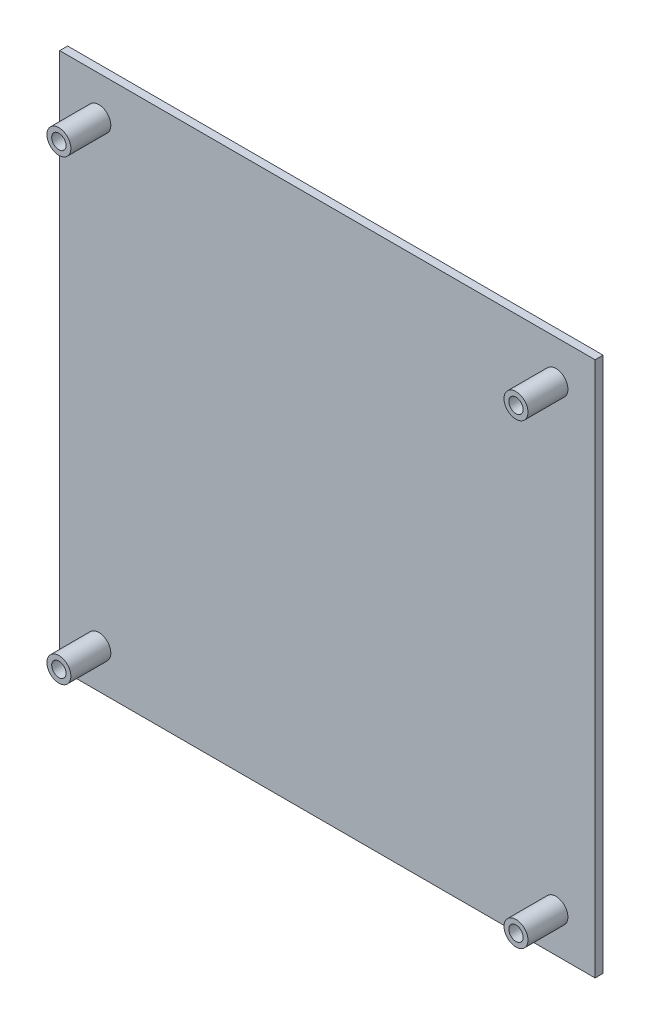
ISO-10303-21;
HEADER;
FILE_DESCRIPTION(('STEP AP214'),'2;1');
FILE_NAME('part.step','',(''),(''),'','','');
FILE_SCHEMA(('AUTOMOTIVE_DESIGN { 1 0 10303 214 1 1 1 1 }'));
ENDSEC;
DATA;
#1=APPLICATION_CONTEXT('core data for automotive mechanical design processes');
#2=APPLICATION_PROTOCOL_DEFINITION('international standard','automotive_design',2000,#1);
#3=PRODUCT_CONTEXT('',#1,'mechanical');
#4=PRODUCT('Part','Part','',(#3));
#5=PRODUCT_RELATED_PRODUCT_CATEGORY('part','',(#4));
#6=PRODUCT_DEFINITION_FORMATION('','',#4);
#7=PRODUCT_DEFINITION_CONTEXT('part definition',#1,'design');
#8=PRODUCT_DEFINITION('design','',#6,#7);
#9=PRODUCT_DEFINITION_SHAPE('','',#8);
#10=(LENGTH_UNIT() NAMED_UNIT(*) SI_UNIT(.MILLI.,.METRE.));
#11=(NAMED_UNIT(*) PLANE_ANGLE_UNIT() SI_UNIT($,.RADIAN.));
#12=(NAMED_UNIT(*) SI_UNIT($,.STERADIAN.) SOLID_ANGLE_UNIT());
#13=UNCERTAINTY_MEASURE_WITH_UNIT(LENGTH_MEASURE(1.E-05),#10,'distance_accuracy_value','');
#14=(GEOMETRIC_REPRESENTATION_CONTEXT(3) GLOBAL_UNCERTAINTY_ASSIGNED_CONTEXT((#13)) GLOBAL_UNIT_ASSIGNED_CONTEXT((#10,
#11,#12)) REPRESENTATION_CONTEXT('',''));
#15=CARTESIAN_POINT('',(0.,0.,0.));
#16=DIRECTION('',(0.,0.,1.));
#17=DIRECTION('',(1.,0.,0.));
#18=AXIS2_PLACEMENT_3D('',#15,#16,#17);
#19=CARTESIAN_POINT('',(0.,0.,5.));
#20=DIRECTION('',(0.,0.,1.));
#21=DIRECTION('',(1.,0.,0.));
#22=AXIS2_PLACEMENT_3D('',#19,#20,#21);
#23=PLANE('',#22);
#24=CARTESIAN_POINT('',(-57.2,-57.2,5.));
#25=DIRECTION('',(0.,0.,1.));
#26=DIRECTION('',(1.,0.,0.));
#27=AXIS2_PLACEMENT_3D('',#24,#25,#26);
#28=CIRCLE('',#27,3.);
#29=CARTESIAN_POINT('',(-54.2,-57.2,5.));
#30=VERTEX_POINT('',#29);
#31=EDGE_CURVE('E204',#30,#30,#28,.F.);
#32=ORIENTED_EDGE('',*,*,#31,.T.);
#33=EDGE_LOOP('',(#32));
#34=FACE_BOUND('',#33,.T.);
#35=CARTESIAN_POINT('',(57.2,57.2,5.));
#36=DIRECTION('',(0.,0.,1.));
#37=DIRECTION('',(1.,0.,0.));
#38=AXIS2_PLACEMENT_3D('',#35,#36,#37);
#39=CIRCLE('',#38,3.);
#40=CARTESIAN_POINT('',(60.2,57.2,5.));
#41=VERTEX_POINT('',#40);
#42=EDGE_CURVE('E220',#41,#41,#39,.F.);
#43=ORIENTED_EDGE('',*,*,#42,.T.);
#44=EDGE_LOOP('',(#43));
#45=FACE_BOUND('',#44,.T.);
#46=DIRECTION('',(0.,1.,0.));
#47=VECTOR('',#46,1.);
#48=CARTESIAN_POINT('',(67.,67.,5.));
#49=LINE('',#48,#47);
#50=CARTESIAN_POINT('',(67.,-67.,5.));
#51=VERTEX_POINT('',#50);
#52=CARTESIAN_POINT('',(67.,67.,5.));
#53=VERTEX_POINT('',#52);
#54=EDGE_CURVE('E149',#51,#53,#49,.T.);
#55=ORIENTED_EDGE('',*,*,#54,.T.);
#56=DIRECTION('',(-1.,0.,0.));
#57=VECTOR('',#56,1.);
#58=CARTESIAN_POINT('',(-67.,67.,5.));
#59=LINE('',#58,#57);
#60=CARTESIAN_POINT('',(-67.,67.,5.));
#61=VERTEX_POINT('',#60);
#62=EDGE_CURVE('E152',#53,#61,#59,.T.);
#63=ORIENTED_EDGE('',*,*,#62,.T.);
#64=DIRECTION('',(0.,-1.,0.));
#65=VECTOR('',#64,1.);
#66=CARTESIAN_POINT('',(-67.,67.,5.));
#67=LINE('',#66,#65);
#68=CARTESIAN_POINT('',(-67.,-67.,5.));
#69=VERTEX_POINT('',#68);
#70=EDGE_CURVE('E154',#61,#69,#67,.T.);
#71=ORIENTED_EDGE('',*,*,#70,.T.);
#72=DIRECTION('',(1.,0.,0.));
#73=VECTOR('',#72,1.);
#74=CARTESIAN_POINT('',(-67.,-67.,5.));
#75=LINE('',#74,#73);
#76=EDGE_CURVE('E156',#69,#51,#75,.T.);
#77=ORIENTED_EDGE('',*,*,#76,.T.);
#78=EDGE_LOOP('',(#55,#63,#71,#77));
#79=FACE_BOUND('',#78,.T.);
#80=CARTESIAN_POINT('',(-57.2,57.2,5.));
#81=DIRECTION('',(0.,0.,1.));
#82=DIRECTION('',(1.,0.,0.));
#83=AXIS2_PLACEMENT_3D('',#80,#81,#82);
#84=CIRCLE('',#83,3.);
#85=CARTESIAN_POINT('',(-54.2,57.2,5.));
#86=VERTEX_POINT('',#85);
#87=EDGE_CURVE('E186',#86,#86,#84,.F.);
#88=ORIENTED_EDGE('',*,*,#87,.T.);
#89=EDGE_LOOP('',(#88));
#90=FACE_BOUND('',#89,.T.);
#91=CARTESIAN_POINT('',(57.2,-57.2,5.));
#92=DIRECTION('',(0.,0.,1.));
#93=DIRECTION('',(1.,0.,0.));
#94=AXIS2_PLACEMENT_3D('',#91,#92,#93);
#95=CIRCLE('',#94,3.);
#96=CARTESIAN_POINT('',(60.2,-57.2,5.));
#97=VERTEX_POINT('',#96);
#98=EDGE_CURVE('E189',#97,#97,#95,.F.);
#99=ORIENTED_EDGE('',*,*,#98,.T.);
#100=EDGE_LOOP('',(#99));
#101=FACE_BOUND('',#100,.T.);
#102=ADVANCED_FACE('F33',(#34,#45,#79,#90,#101),#23,.T.);
#103=CARTESIAN_POINT('',(67.,67.,5.));
#104=DIRECTION('',(-1.,0.,0.));
#105=DIRECTION('',(0.,-1.,0.));
#106=AXIS2_PLACEMENT_3D('',#103,#104,#105);
#107=PLANE('',#106);
#108=DIRECTION('',(0.,0.,-1.));
#109=VECTOR('',#108,1.);
#110=CARTESIAN_POINT('',(67.,-67.,5.));
#111=LINE('',#110,#109);
#112=CARTESIAN_POINT('',(67.,-67.,3.));
#113=VERTEX_POINT('',#112);
#114=EDGE_CURVE('E158',#51,#113,#111,.T.);
#115=ORIENTED_EDGE('',*,*,#114,.T.);
#116=DIRECTION('',(0.,1.,0.));
#117=VECTOR('',#116,1.);
#118=CARTESIAN_POINT('',(67.,67.,3.));
#119=LINE('',#118,#117);
#120=CARTESIAN_POINT('',(67.,67.,3.));
#121=VERTEX_POINT('',#120);
#122=EDGE_CURVE('E48',#113,#121,#119,.T.);
#123=ORIENTED_EDGE('',*,*,#122,.T.);
#124=DIRECTION('',(0.,0.,-1.));
#125=VECTOR('',#124,1.);
#126=CARTESIAN_POINT('',(67.,67.,5.));
#127=LINE('',#126,#125);
#128=EDGE_CURVE('E11',#53,#121,#127,.T.);
#129=ORIENTED_EDGE('',*,*,#128,.F.);
#130=ORIENTED_EDGE('',*,*,#54,.F.);
#131=EDGE_LOOP('',(#115,#123,#129,#130));
#132=FACE_BOUND('',#131,.T.);
#133=ADVANCED_FACE('F35',(#132),#107,.F.);
#134=CARTESIAN_POINT('',(-67.,67.,5.));
#135=DIRECTION('',(0.,-1.,0.));
#136=DIRECTION('',(0.,0.,-1.));
#137=AXIS2_PLACEMENT_3D('',#134,#135,#136);
#138=PLANE('',#137);
#139=ORIENTED_EDGE('',*,*,#128,.T.);
#140=DIRECTION('',(-1.,0.,0.));
#141=VECTOR('',#140,1.);
#142=CARTESIAN_POINT('',(-67.,67.,3.));
#143=LINE('',#142,#141);
#144=CARTESIAN_POINT('',(-67.,67.,3.));
#145=VERTEX_POINT('',#144);
#146=EDGE_CURVE('E146',#121,#145,#143,.T.);
#147=ORIENTED_EDGE('',*,*,#146,.T.);
#148=DIRECTION('',(0.,0.,-1.));
#149=VECTOR('',#148,1.);
#150=CARTESIAN_POINT('',(-67.,67.,5.));
#151=LINE('',#150,#149);
#152=EDGE_CURVE('E41',#61,#145,#151,.T.);
#153=ORIENTED_EDGE('',*,*,#152,.F.);
#154=ORIENTED_EDGE('',*,*,#62,.F.);
#155=EDGE_LOOP('',(#139,#147,#153,#154));
#156=FACE_BOUND('',#155,.T.);
#157=ADVANCED_FACE('F170',(#156),#138,.F.);
#158=CARTESIAN_POINT('',(-67.,67.,5.));
#159=DIRECTION('',(1.,0.,0.));
#160=DIRECTION('',(0.,1.,0.));
#161=AXIS2_PLACEMENT_3D('',#158,#159,#160);
#162=PLANE('',#161);
#163=ORIENTED_EDGE('',*,*,#152,.T.);
#164=DIRECTION('',(0.,-1.,0.));
#165=VECTOR('',#164,1.);
#166=CARTESIAN_POINT('',(-67.,67.,3.));
#167=LINE('',#166,#165);
#168=CARTESIAN_POINT('',(-67.,-67.,3.));
#169=VERTEX_POINT('',#168);
#170=EDGE_CURVE('E118',#145,#169,#167,.T.);
#171=ORIENTED_EDGE('',*,*,#170,.T.);
#172=DIRECTION('',(0.,0.,-1.));
#173=VECTOR('',#172,1.);
#174=CARTESIAN_POINT('',(-67.,-67.,5.));
#175=LINE('',#174,#173);
#176=EDGE_CURVE('E161',#69,#169,#175,.T.);
#177=ORIENTED_EDGE('',*,*,#176,.F.);
#178=ORIENTED_EDGE('',*,*,#70,.F.);
#179=EDGE_LOOP('',(#163,#171,#177,#178));
#180=FACE_BOUND('',#179,.T.);
#181=ADVANCED_FACE('F167',(#180),#162,.F.);
#182=CARTESIAN_POINT('',(-67.,-67.,5.));
#183=DIRECTION('',(0.,1.,0.));
#184=DIRECTION('',(0.,0.,1.));
#185=AXIS2_PLACEMENT_3D('',#182,#183,#184);
#186=PLANE('',#185);
#187=ORIENTED_EDGE('',*,*,#176,.T.);
#188=DIRECTION('',(1.,0.,0.));
#189=VECTOR('',#188,1.);
#190=CARTESIAN_POINT('',(-67.,-67.,3.));
#191=LINE('',#190,#189);
#192=EDGE_CURVE('E143',#169,#113,#191,.T.);
#193=ORIENTED_EDGE('',*,*,#192,.T.);
#194=ORIENTED_EDGE('',*,*,#114,.F.);
#195=ORIENTED_EDGE('',*,*,#76,.F.);
#196=EDGE_LOOP('',(#187,#193,#194,#195));
#197=FACE_BOUND('',#196,.T.);
#198=ADVANCED_FACE('F177',(#197),#186,.F.);
#199=CARTESIAN_POINT('',(0.,0.,3.));
#200=DIRECTION('',(0.,0.,1.));
#201=DIRECTION('',(1.,0.,0.));
#202=AXIS2_PLACEMENT_3D('',#199,#200,#201);
#203=PLANE('',#202);
#204=ORIENTED_EDGE('',*,*,#170,.F.);
#205=ORIENTED_EDGE('',*,*,#146,.F.);
#206=ORIENTED_EDGE('',*,*,#122,.F.);
#207=ORIENTED_EDGE('',*,*,#192,.F.);
#208=EDGE_LOOP('',(#204,#205,#206,#207));
#209=FACE_BOUND('',#208,.T.);
#210=DIRECTION('',(1.,0.,0.));
#211=VECTOR('',#210,1.);
#212=CARTESIAN_POINT('',(63.,-63.,3.));
#213=LINE('',#212,#211);
#214=CARTESIAN_POINT('',(-63.,-63.,3.));
#215=VERTEX_POINT('',#214);
#216=CARTESIAN_POINT('',(63.,-63.,3.));
#217=VERTEX_POINT('',#216);
#218=EDGE_CURVE('E102',#215,#217,#213,.T.);
#219=ORIENTED_EDGE('',*,*,#218,.T.);
#220=DIRECTION('',(0.,1.,0.));
#221=VECTOR('',#220,1.);
#222=CARTESIAN_POINT('',(63.,63.,3.));
#223=LINE('',#222,#221);
#224=CARTESIAN_POINT('',(63.,63.,3.));
#225=VERTEX_POINT('',#224);
#226=EDGE_CURVE('E123',#217,#225,#223,.T.);
#227=ORIENTED_EDGE('',*,*,#226,.T.);
#228=DIRECTION('',(-1.,0.,0.));
#229=VECTOR('',#228,1.);
#230=CARTESIAN_POINT('',(63.,63.,3.));
#231=LINE('',#230,#229);
#232=CARTESIAN_POINT('',(-63.,63.,3.));
#233=VERTEX_POINT('',#232);
#234=EDGE_CURVE('E105',#225,#233,#231,.T.);
#235=ORIENTED_EDGE('',*,*,#234,.T.);
#236=DIRECTION('',(0.,-1.,0.));
#237=VECTOR('',#236,1.);
#238=CARTESIAN_POINT('',(-63.,63.,3.));
#239=LINE('',#238,#237);
#240=EDGE_CURVE('E97',#233,#215,#239,.T.);
#241=ORIENTED_EDGE('',*,*,#240,.T.);
#242=EDGE_LOOP('',(#219,#227,#235,#241));
#243=FACE_BOUND('',#242,.T.);
#244=ADVANCED_FACE('F99',(#209,#243),#203,.F.);
#245=CARTESIAN_POINT('',(-63.,63.,3.));
#246=DIRECTION('',(1.,0.,0.));
#247=DIRECTION('',(0.,0.,-1.));
#248=AXIS2_PLACEMENT_3D('',#245,#246,#247);
#249=PLANE('',#248);
#250=DIRECTION('',(0.,-1.,0.));
#251=VECTOR('',#250,1.);
#252=CARTESIAN_POINT('',(-63.,63.,0.));
#253=LINE('',#252,#251);
#254=CARTESIAN_POINT('',(-63.,63.,0.));
#255=VERTEX_POINT('',#254);
#256=CARTESIAN_POINT('',(-63.,-63.,0.));
#257=VERTEX_POINT('',#256);
#258=EDGE_CURVE('E114',#255,#257,#253,.T.);
#259=ORIENTED_EDGE('',*,*,#258,.T.);
#260=DIRECTION('',(0.,0.,-1.));
#261=VECTOR('',#260,1.);
#262=CARTESIAN_POINT('',(-63.,-63.,3.));
#263=LINE('',#262,#261);
#264=EDGE_CURVE('E111',#215,#257,#263,.T.);
#265=ORIENTED_EDGE('',*,*,#264,.F.);
#266=ORIENTED_EDGE('',*,*,#240,.F.);
#267=DIRECTION('',(0.,0.,-1.));
#268=VECTOR('',#267,1.);
#269=CARTESIAN_POINT('',(-63.,63.,3.));
#270=LINE('',#269,#268);
#271=EDGE_CURVE('E129',#233,#255,#270,.T.);
#272=ORIENTED_EDGE('',*,*,#271,.T.);
#273=EDGE_LOOP('',(#259,#265,#266,#272));
#274=FACE_BOUND('',#273,.T.);
#275=ADVANCED_FACE('F112',(#274),#249,.F.);
#276=CARTESIAN_POINT('',(63.,-63.,3.));
#277=DIRECTION('',(0.,1.,0.));
#278=DIRECTION('',(0.,0.,1.));
#279=AXIS2_PLACEMENT_3D('',#276,#277,#278);
#280=PLANE('',#279);
#281=DIRECTION('',(1.,0.,0.));
#282=VECTOR('',#281,1.);
#283=CARTESIAN_POINT('',(63.,-63.,0.));
#284=LINE('',#283,#282);
#285=CARTESIAN_POINT('',(63.,-63.,0.));
#286=VERTEX_POINT('',#285);
#287=EDGE_CURVE('E131',#257,#286,#284,.T.);
#288=ORIENTED_EDGE('',*,*,#287,.T.);
#289=DIRECTION('',(0.,0.,-1.));
#290=VECTOR('',#289,1.);
#291=CARTESIAN_POINT('',(63.,-63.,3.));
#292=LINE('',#291,#290);
#293=EDGE_CURVE('E119',#217,#286,#292,.T.);
#294=ORIENTED_EDGE('',*,*,#293,.F.);
#295=ORIENTED_EDGE('',*,*,#218,.F.);
#296=ORIENTED_EDGE('',*,*,#264,.T.);
#297=EDGE_LOOP('',(#288,#294,#295,#296));
#298=FACE_BOUND('',#297,.T.);
#299=ADVANCED_FACE('F121',(#298),#280,.F.);
#300=CARTESIAN_POINT('',(63.,63.,3.));
#301=DIRECTION('',(-1.,0.,0.));
#302=DIRECTION('',(0.,0.,1.));
#303=AXIS2_PLACEMENT_3D('',#300,#301,#302);
#304=PLANE('',#303);
#305=DIRECTION('',(0.,1.,0.));
#306=VECTOR('',#305,1.);
#307=CARTESIAN_POINT('',(63.,63.,0.));
#308=LINE('',#307,#306);
#309=CARTESIAN_POINT('',(63.,63.,0.));
#310=VERTEX_POINT('',#309);
#311=EDGE_CURVE('E56',#286,#310,#308,.T.);
#312=ORIENTED_EDGE('',*,*,#311,.T.);
#313=DIRECTION('',(0.,0.,-1.));
#314=VECTOR('',#313,1.);
#315=CARTESIAN_POINT('',(63.,63.,3.));
#316=LINE('',#315,#314);
#317=EDGE_CURVE('E138',#225,#310,#316,.T.);
#318=ORIENTED_EDGE('',*,*,#317,.F.);
#319=ORIENTED_EDGE('',*,*,#226,.F.);
#320=ORIENTED_EDGE('',*,*,#293,.T.);
#321=EDGE_LOOP('',(#312,#318,#319,#320));
#322=FACE_BOUND('',#321,.T.);
#323=ADVANCED_FACE('F273',(#322),#304,.F.);
#324=CARTESIAN_POINT('',(63.,63.,3.));
#325=DIRECTION('',(0.,-1.,0.));
#326=DIRECTION('',(0.,0.,-1.));
#327=AXIS2_PLACEMENT_3D('',#324,#325,#326);
#328=PLANE('',#327);
#329=DIRECTION('',(-1.,0.,0.));
#330=VECTOR('',#329,1.);
#331=CARTESIAN_POINT('',(63.,63.,0.));
#332=LINE('',#331,#330);
#333=EDGE_CURVE('E108',#310,#255,#332,.T.);
#334=ORIENTED_EDGE('',*,*,#333,.T.);
#335=ORIENTED_EDGE('',*,*,#271,.F.);
#336=ORIENTED_EDGE('',*,*,#234,.F.);
#337=ORIENTED_EDGE('',*,*,#317,.T.);
#338=EDGE_LOOP('',(#334,#335,#336,#337));
#339=FACE_BOUND('',#338,.T.);
#340=ADVANCED_FACE('F270',(#339),#328,.F.);
#341=CARTESIAN_POINT('',(0.,0.,0.));
#342=DIRECTION('',(0.,0.,1.));
#343=DIRECTION('',(1.,0.,0.));
#344=AXIS2_PLACEMENT_3D('',#341,#342,#343);
#345=PLANE('',#344);
#346=CARTESIAN_POINT('',(57.2,-57.2,0.));
#347=DIRECTION('',(0.,0.,1.));
#348=DIRECTION('',(1.,0.,0.));
#349=AXIS2_PLACEMENT_3D('',#346,#347,#348);
#350=CIRCLE('',#349,1.8);
#351=CARTESIAN_POINT('',(59.,-57.2,0.));
#352=VERTEX_POINT('',#351);
#353=EDGE_CURVE('E224',#352,#352,#350,.T.);
#354=ORIENTED_EDGE('',*,*,#353,.T.);
#355=EDGE_LOOP('',(#354));
#356=FACE_BOUND('',#355,.T.);
#357=CARTESIAN_POINT('',(-57.2,57.2,0.));
#358=DIRECTION('',(0.,0.,1.));
#359=DIRECTION('',(1.,0.,0.));
#360=AXIS2_PLACEMENT_3D('',#357,#358,#359);
#361=CIRCLE('',#360,1.79999999999999);
#362=CARTESIAN_POINT('',(-55.4,57.2,0.));
#363=VERTEX_POINT('',#362);
#364=EDGE_CURVE('E223',#363,#363,#361,.T.);
#365=ORIENTED_EDGE('',*,*,#364,.T.);
#366=EDGE_LOOP('',(#365));
#367=FACE_BOUND('',#366,.T.);
#368=ORIENTED_EDGE('',*,*,#287,.F.);
#369=ORIENTED_EDGE('',*,*,#258,.F.);
#370=ORIENTED_EDGE('',*,*,#333,.F.);
#371=ORIENTED_EDGE('',*,*,#311,.F.);
#372=EDGE_LOOP('',(#368,#369,#370,#371));
#373=FACE_BOUND('',#372,.T.);
#374=CARTESIAN_POINT('',(57.2,57.2,0.));
#375=DIRECTION('',(0.,0.,1.));
#376=DIRECTION('',(1.,0.,0.));
#377=AXIS2_PLACEMENT_3D('',#374,#375,#376);
#378=CIRCLE('',#377,1.8);
#379=CARTESIAN_POINT('',(59.,57.2,0.));
#380=VERTEX_POINT('',#379);
#381=EDGE_CURVE('E132',#380,#380,#378,.T.);
#382=ORIENTED_EDGE('',*,*,#381,.T.);
#383=EDGE_LOOP('',(#382));
#384=FACE_BOUND('',#383,.T.);
#385=CARTESIAN_POINT('',(-57.2,-57.2,0.));
#386=DIRECTION('',(0.,0.,1.));
#387=DIRECTION('',(1.,0.,0.));
#388=AXIS2_PLACEMENT_3D('',#385,#386,#387);
#389=CIRCLE('',#388,1.8);
#390=CARTESIAN_POINT('',(-55.4,-57.2,0.));
#391=VERTEX_POINT('',#390);
#392=EDGE_CURVE('E227',#391,#391,#389,.T.);
#393=ORIENTED_EDGE('',*,*,#392,.T.);
#394=EDGE_LOOP('',(#393));
#395=FACE_BOUND('',#394,.T.);
#396=ADVANCED_FACE('F234',(#356,#367,#373,#384,#395),#345,.F.);
#397=CARTESIAN_POINT('',(57.2,57.2,6.));
#398=DIRECTION('',(0.,0.,-1.));
#399=DIRECTION('',(-1.,0.,0.));
#400=AXIS2_PLACEMENT_3D('',#397,#398,#399);
#401=CYLINDRICAL_SURFACE('',#400,1.8);
#402=ORIENTED_EDGE('',*,*,#381,.F.);
#403=EDGE_LOOP('',(#402));
#404=FACE_BOUND('',#403,.T.);
#405=CARTESIAN_POINT('',(57.2,57.2,15.));
#406=DIRECTION('',(0.,0.,1.));
#407=DIRECTION('',(1.,0.,0.));
#408=AXIS2_PLACEMENT_3D('',#405,#406,#407);
#409=CIRCLE('',#408,1.80000000000001);
#410=CARTESIAN_POINT('',(59.,57.2,15.));
#411=VERTEX_POINT('',#410);
#412=EDGE_CURVE('E214',#411,#411,#409,.T.);
#413=ORIENTED_EDGE('',*,*,#412,.T.);
#414=EDGE_LOOP('',(#413));
#415=FACE_BOUND('',#414,.T.);
#416=ADVANCED_FACE('F237',(#404,#415),#401,.F.);
#417=CARTESIAN_POINT('',(57.2,-57.2,6.));
#418=DIRECTION('',(0.,0.,-1.));
#419=DIRECTION('',(-1.,0.,0.));
#420=AXIS2_PLACEMENT_3D('',#417,#418,#419);
#421=CYLINDRICAL_SURFACE('',#420,1.8);
#422=ORIENTED_EDGE('',*,*,#353,.F.);
#423=EDGE_LOOP('',(#422));
#424=FACE_BOUND('',#423,.T.);
#425=CARTESIAN_POINT('',(57.2,-57.2,15.));
#426=DIRECTION('',(0.,0.,1.));
#427=DIRECTION('',(1.,0.,0.));
#428=AXIS2_PLACEMENT_3D('',#425,#426,#427);
#429=CIRCLE('',#428,1.8);
#430=CARTESIAN_POINT('',(59.,-57.2,15.));
#431=VERTEX_POINT('',#430);
#432=EDGE_CURVE('E198',#431,#431,#429,.T.);
#433=ORIENTED_EDGE('',*,*,#432,.T.);
#434=EDGE_LOOP('',(#433));
#435=FACE_BOUND('',#434,.T.);
#436=ADVANCED_FACE('F240',(#424,#435),#421,.F.);
#437=CARTESIAN_POINT('',(-57.2,-57.2,6.));
#438=DIRECTION('',(0.,0.,-1.));
#439=DIRECTION('',(-1.,0.,0.));
#440=AXIS2_PLACEMENT_3D('',#437,#438,#439);
#441=CYLINDRICAL_SURFACE('',#440,1.8);
#442=ORIENTED_EDGE('',*,*,#392,.F.);
#443=EDGE_LOOP('',(#442));
#444=FACE_BOUND('',#443,.T.);
#445=CARTESIAN_POINT('',(-57.2,-57.2,15.));
#446=DIRECTION('',(0.,0.,1.));
#447=DIRECTION('',(1.,0.,0.));
#448=AXIS2_PLACEMENT_3D('',#445,#446,#447);
#449=CIRCLE('',#448,1.8);
#450=CARTESIAN_POINT('',(-55.4,-57.2,15.));
#451=VERTEX_POINT('',#450);
#452=EDGE_CURVE('E191',#451,#451,#449,.T.);
#453=ORIENTED_EDGE('',*,*,#452,.T.);
#454=EDGE_LOOP('',(#453));
#455=FACE_BOUND('',#454,.T.);
#456=ADVANCED_FACE('F257',(#444,#455),#441,.F.);
#457=CARTESIAN_POINT('',(-57.2,57.2,6.));
#458=DIRECTION('',(0.,0.,-1.));
#459=DIRECTION('',(-1.,0.,0.));
#460=AXIS2_PLACEMENT_3D('',#457,#458,#459);
#461=CYLINDRICAL_SURFACE('',#460,1.79999999999999);
#462=ORIENTED_EDGE('',*,*,#364,.F.);
#463=EDGE_LOOP('',(#462));
#464=FACE_BOUND('',#463,.T.);
#465=CARTESIAN_POINT('',(-57.2,57.2,15.));
#466=DIRECTION('',(0.,0.,1.));
#467=DIRECTION('',(1.,0.,0.));
#468=AXIS2_PLACEMENT_3D('',#465,#466,#467);
#469=CIRCLE('',#468,1.79999999999999);
#470=CARTESIAN_POINT('',(-55.4,57.2,15.));
#471=VERTEX_POINT('',#470);
#472=EDGE_CURVE('E207',#471,#471,#469,.T.);
#473=ORIENTED_EDGE('',*,*,#472,.T.);
#474=EDGE_LOOP('',(#473));
#475=FACE_BOUND('',#474,.T.);
#476=ADVANCED_FACE('F247',(#464,#475),#461,.F.);
#477=CARTESIAN_POINT('',(57.2,57.2,15.));
#478=DIRECTION('',(0.,0.,1.));
#479=DIRECTION('',(1.,0.,0.));
#480=AXIS2_PLACEMENT_3D('',#477,#478,#479);
#481=PLANE('',#480);
#482=CARTESIAN_POINT('',(57.2,57.2,15.));
#483=DIRECTION('',(0.,0.,1.));
#484=DIRECTION('',(1.,0.,0.));
#485=AXIS2_PLACEMENT_3D('',#482,#483,#484);
#486=CIRCLE('',#485,3.);
#487=CARTESIAN_POINT('',(60.2,57.2,15.));
#488=VERTEX_POINT('',#487);
#489=EDGE_CURVE('E217',#488,#488,#486,.T.);
#490=ORIENTED_EDGE('',*,*,#489,.T.);
#491=EDGE_LOOP('',(#490));
#492=FACE_BOUND('',#491,.T.);
#493=ORIENTED_EDGE('',*,*,#412,.F.);
#494=EDGE_LOOP('',(#493));
#495=FACE_BOUND('',#494,.T.);
#496=ADVANCED_FACE('F244',(#492,#495),#481,.T.);
#497=CARTESIAN_POINT('',(57.2,57.2,15.));
#498=DIRECTION('',(0.,0.,-1.));
#499=DIRECTION('',(-1.,0.,0.));
#500=AXIS2_PLACEMENT_3D('',#497,#498,#499);
#501=CYLINDRICAL_SURFACE('',#500,3.);
#502=ORIENTED_EDGE('',*,*,#42,.F.);
#503=EDGE_LOOP('',(#502));
#504=FACE_BOUND('',#503,.T.);
#505=ORIENTED_EDGE('',*,*,#489,.F.);
#506=EDGE_LOOP('',(#505));
#507=FACE_BOUND('',#506,.T.);
#508=ADVANCED_FACE('F246',(#504,#507),#501,.T.);
#509=CARTESIAN_POINT('',(-57.2,57.2,15.));
#510=DIRECTION('',(0.,0.,1.));
#511=DIRECTION('',(1.,0.,0.));
#512=AXIS2_PLACEMENT_3D('',#509,#510,#511);
#513=PLANE('',#512);
#514=CARTESIAN_POINT('',(-57.2,57.2,15.));
#515=DIRECTION('',(0.,0.,1.));
#516=DIRECTION('',(1.,0.,0.));
#517=AXIS2_PLACEMENT_3D('',#514,#515,#516);
#518=CIRCLE('',#517,3.);
#519=CARTESIAN_POINT('',(-54.2,57.2,15.));
#520=VERTEX_POINT('',#519);
#521=EDGE_CURVE('E210',#520,#520,#518,.T.);
#522=ORIENTED_EDGE('',*,*,#521,.T.);
#523=EDGE_LOOP('',(#522));
#524=FACE_BOUND('',#523,.T.);
#525=ORIENTED_EDGE('',*,*,#472,.F.);
#526=EDGE_LOOP('',(#525));
#527=FACE_BOUND('',#526,.T.);
#528=ADVANCED_FACE('F254',(#524,#527),#513,.T.);
#529=CARTESIAN_POINT('',(-57.2,57.2,15.));
#530=DIRECTION('',(0.,0.,-1.));
#531=DIRECTION('',(-1.,0.,0.));
#532=AXIS2_PLACEMENT_3D('',#529,#530,#531);
#533=CYLINDRICAL_SURFACE('',#532,3.);
#534=ORIENTED_EDGE('',*,*,#87,.F.);
#535=EDGE_LOOP('',(#534));
#536=FACE_BOUND('',#535,.T.);
#537=ORIENTED_EDGE('',*,*,#521,.F.);
#538=EDGE_LOOP('',(#537));
#539=FACE_BOUND('',#538,.T.);
#540=ADVANCED_FACE('F261',(#536,#539),#533,.T.);
#541=CARTESIAN_POINT('',(-57.2,-57.2,15.));
#542=DIRECTION('',(0.,0.,1.));
#543=DIRECTION('',(1.,0.,0.));
#544=AXIS2_PLACEMENT_3D('',#541,#542,#543);
#545=PLANE('',#544);
#546=CARTESIAN_POINT('',(-57.2,-57.2,15.));
#547=DIRECTION('',(0.,0.,1.));
#548=DIRECTION('',(1.,0.,0.));
#549=AXIS2_PLACEMENT_3D('',#546,#547,#548);
#550=CIRCLE('',#549,3.);
#551=CARTESIAN_POINT('',(-54.2,-57.2,15.));
#552=VERTEX_POINT('',#551);
#553=EDGE_CURVE('E195',#552,#552,#550,.T.);
#554=ORIENTED_EDGE('',*,*,#553,.T.);
#555=EDGE_LOOP('',(#554));
#556=FACE_BOUND('',#555,.T.);
#557=ORIENTED_EDGE('',*,*,#452,.F.);
#558=EDGE_LOOP('',(#557));
#559=FACE_BOUND('',#558,.T.);
#560=ADVANCED_FACE('F345',(#556,#559),#545,.T.);
#561=CARTESIAN_POINT('',(-57.2,-57.2,15.));
#562=DIRECTION('',(0.,0.,-1.));
#563=DIRECTION('',(-1.,0.,0.));
#564=AXIS2_PLACEMENT_3D('',#561,#562,#563);
#565=CYLINDRICAL_SURFACE('',#564,3.);
#566=ORIENTED_EDGE('',*,*,#31,.F.);
#567=EDGE_LOOP('',(#566));
#568=FACE_BOUND('',#567,.T.);
#569=ORIENTED_EDGE('',*,*,#553,.F.);
#570=EDGE_LOOP('',(#569));
#571=FACE_BOUND('',#570,.T.);
#572=ADVANCED_FACE('F307',(#568,#571),#565,.T.);
#573=CARTESIAN_POINT('',(57.2,-57.2,15.));
#574=DIRECTION('',(0.,0.,1.));
#575=DIRECTION('',(1.,0.,0.));
#576=AXIS2_PLACEMENT_3D('',#573,#574,#575);
#577=PLANE('',#576);
#578=CARTESIAN_POINT('',(57.2,-57.2,15.));
#579=DIRECTION('',(0.,0.,1.));
#580=DIRECTION('',(1.,0.,0.));
#581=AXIS2_PLACEMENT_3D('',#578,#579,#580);
#582=CIRCLE('',#581,3.);
#583=CARTESIAN_POINT('',(60.2,-57.2,15.));
#584=VERTEX_POINT('',#583);
#585=EDGE_CURVE('E192',#584,#584,#582,.T.);
#586=ORIENTED_EDGE('',*,*,#585,.T.);
#587=EDGE_LOOP('',(#586));
#588=FACE_BOUND('',#587,.T.);
#589=ORIENTED_EDGE('',*,*,#432,.F.);
#590=EDGE_LOOP('',(#589));
#591=FACE_BOUND('',#590,.T.);
#592=ADVANCED_FACE('F326',(#588,#591),#577,.T.);
#593=CARTESIAN_POINT('',(57.2,-57.2,15.));
#594=DIRECTION('',(0.,0.,-1.));
#595=DIRECTION('',(-1.,0.,0.));
#596=AXIS2_PLACEMENT_3D('',#593,#594,#595);
#597=CYLINDRICAL_SURFACE('',#596,3.);
#598=ORIENTED_EDGE('',*,*,#98,.F.);
#599=EDGE_LOOP('',(#598));
#600=FACE_BOUND('',#599,.T.);
#601=ORIENTED_EDGE('',*,*,#585,.F.);
#602=EDGE_LOOP('',(#601));
#603=FACE_BOUND('',#602,.T.);
#604=ADVANCED_FACE('F330',(#600,#603),#597,.T.);
#605=CLOSED_SHELL('',(#102,#133,#157,#181,#198,#244,#275,#299,#323,#340,#396,#416,#436,#456,
#476,#496,#508,#528,#540,#560,#572,#592,#604));
#606=MANIFOLD_SOLID_BREP('B2',#605);
#607=ADVANCED_BREP_SHAPE_REPRESENTATION('',(#18,#606),#14);
#608=SHAPE_DEFINITION_REPRESENTATION(#9,#607);
ENDSEC;
END-ISO-10303-21;
